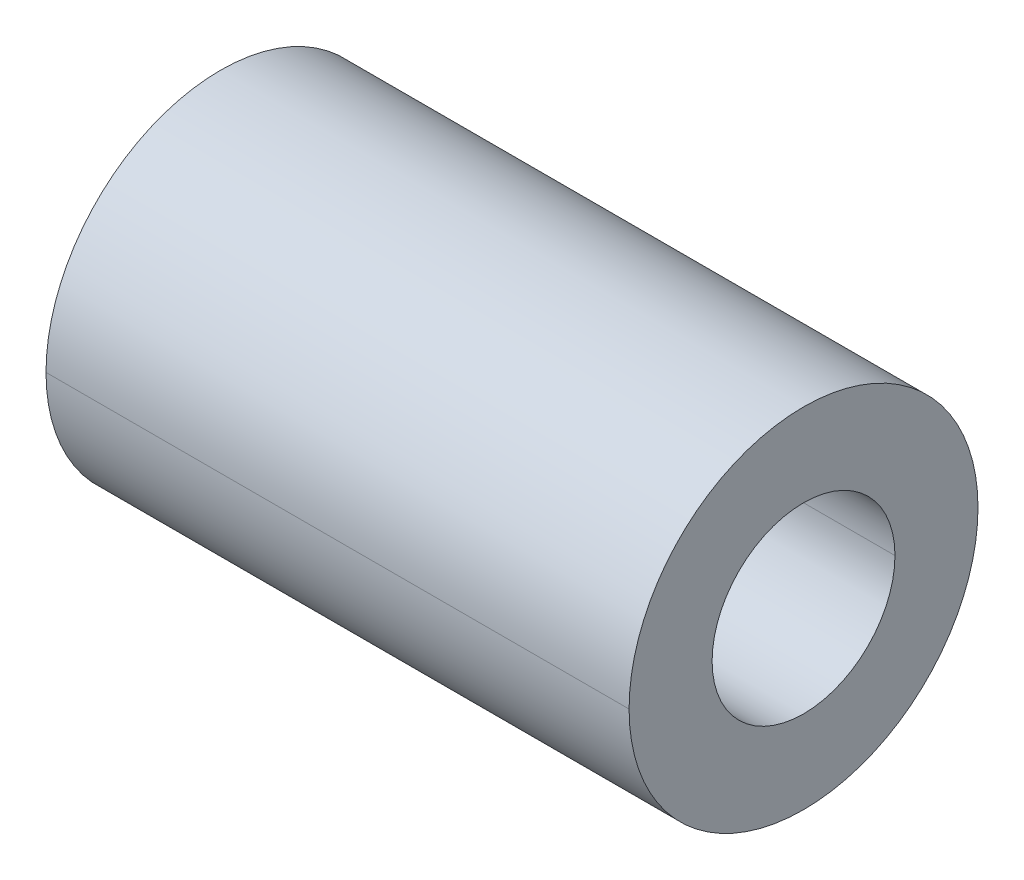
ISO-10303-21;
HEADER;
FILE_DESCRIPTION(('STEP AP214'),'2;1');
FILE_NAME('part.step','',(''),(''),'','','');
FILE_SCHEMA(('AUTOMOTIVE_DESIGN { 1 0 10303 214 1 1 1 1 }'));
ENDSEC;
DATA;
#1=APPLICATION_CONTEXT('core data for automotive mechanical design processes');
#2=APPLICATION_PROTOCOL_DEFINITION('international standard','automotive_design',2000,#1);
#3=PRODUCT_CONTEXT('',#1,'mechanical');
#4=PRODUCT('Part','Part','',(#3));
#5=PRODUCT_RELATED_PRODUCT_CATEGORY('part','',(#4));
#6=PRODUCT_DEFINITION_FORMATION('','',#4);
#7=PRODUCT_DEFINITION_CONTEXT('part definition',#1,'design');
#8=PRODUCT_DEFINITION('design','',#6,#7);
#9=PRODUCT_DEFINITION_SHAPE('','',#8);
#10=(LENGTH_UNIT() NAMED_UNIT(*) SI_UNIT(.MILLI.,.METRE.));
#11=(NAMED_UNIT(*) PLANE_ANGLE_UNIT() SI_UNIT($,.RADIAN.));
#12=(NAMED_UNIT(*) SI_UNIT($,.STERADIAN.) SOLID_ANGLE_UNIT());
#13=UNCERTAINTY_MEASURE_WITH_UNIT(LENGTH_MEASURE(1.E-05),#10,'distance_accuracy_value','');
#14=(GEOMETRIC_REPRESENTATION_CONTEXT(3) GLOBAL_UNCERTAINTY_ASSIGNED_CONTEXT((#13)) GLOBAL_UNIT_ASSIGNED_CONTEXT((#10,
#11,#12)) REPRESENTATION_CONTEXT('',''));
#15=CARTESIAN_POINT('',(0.,0.,0.));
#16=DIRECTION('',(0.,0.,1.));
#17=DIRECTION('',(1.,0.,0.));
#18=AXIS2_PLACEMENT_3D('',#15,#16,#17);
#19=CARTESIAN_POINT('',(7.9375,0.,0.));
#20=DIRECTION('',(-1.,0.,0.));
#21=DIRECTION('',(0.,0.,1.));
#22=AXIS2_PLACEMENT_3D('',#19,#20,#21);
#23=CYLINDRICAL_SURFACE('',#22,2.4892);
#24=DIRECTION('',(-1.,0.,0.));
#25=VECTOR('',#24,1.);
#26=CARTESIAN_POINT('',(7.9375,0.,-2.4892));
#27=LINE('',#26,#25);
#28=CARTESIAN_POINT('',(7.9375,0.,-2.4892));
#29=VERTEX_POINT('',#28);
#30=CARTESIAN_POINT('',(-7.9375,0.,-2.4892));
#31=VERTEX_POINT('',#30);
#32=EDGE_CURVE('E74',#29,#31,#27,.T.);
#33=ORIENTED_EDGE('',*,*,#32,.F.);
#34=CARTESIAN_POINT('',(7.9375,0.,0.));
#35=DIRECTION('',(1.,0.,0.));
#36=DIRECTION('',(0.,0.,-1.));
#37=AXIS2_PLACEMENT_3D('',#34,#35,#36);
#38=CIRCLE('',#37,2.4892);
#39=CARTESIAN_POINT('',(7.9375,0.,2.4892));
#40=VERTEX_POINT('',#39);
#41=EDGE_CURVE('E61',#29,#40,#38,.T.);
#42=ORIENTED_EDGE('',*,*,#41,.T.);
#43=DIRECTION('',(-1.,0.,0.));
#44=VECTOR('',#43,1.);
#45=CARTESIAN_POINT('',(7.9375,0.,2.4892));
#46=LINE('',#45,#44);
#47=CARTESIAN_POINT('',(-7.9375,0.,2.4892));
#48=VERTEX_POINT('',#47);
#49=EDGE_CURVE('E19',#40,#48,#46,.T.);
#50=ORIENTED_EDGE('',*,*,#49,.T.);
#51=CARTESIAN_POINT('',(-7.9375,0.,0.));
#52=DIRECTION('',(1.,0.,0.));
#53=DIRECTION('',(0.,0.,-1.));
#54=AXIS2_PLACEMENT_3D('',#51,#52,#53);
#55=CIRCLE('',#54,2.4892);
#56=EDGE_CURVE('E10',#31,#48,#55,.T.);
#57=ORIENTED_EDGE('',*,*,#56,.F.);
#58=EDGE_LOOP('',(#33,#42,#50,#57));
#59=FACE_BOUND('',#58,.T.);
#60=ADVANCED_FACE('F15',(#59),#23,.F.);
#61=CARTESIAN_POINT('',(7.9375,0.,0.));
#62=DIRECTION('',(-1.,0.,0.));
#63=DIRECTION('',(0.,0.,1.));
#64=AXIS2_PLACEMENT_3D('',#61,#62,#63);
#65=CYLINDRICAL_SURFACE('',#64,4.7498);
#66=DIRECTION('',(-1.,0.,0.));
#67=VECTOR('',#66,1.);
#68=CARTESIAN_POINT('',(7.9375,0.,-4.7498));
#69=LINE('',#68,#67);
#70=CARTESIAN_POINT('',(7.9375,0.,-4.7498));
#71=VERTEX_POINT('',#70);
#72=CARTESIAN_POINT('',(-7.9375,0.,-4.7498));
#73=VERTEX_POINT('',#72);
#74=EDGE_CURVE('E131',#71,#73,#69,.T.);
#75=ORIENTED_EDGE('',*,*,#74,.F.);
#76=CARTESIAN_POINT('',(7.9375,0.,0.));
#77=DIRECTION('',(1.,0.,0.));
#78=DIRECTION('',(0.,0.,-1.));
#79=AXIS2_PLACEMENT_3D('',#76,#77,#78);
#80=CIRCLE('',#79,4.7498);
#81=CARTESIAN_POINT('',(7.9375,0.,4.7498));
#82=VERTEX_POINT('',#81);
#83=EDGE_CURVE('E77',#82,#71,#80,.T.);
#84=ORIENTED_EDGE('',*,*,#83,.F.);
#85=DIRECTION('',(-1.,0.,0.));
#86=VECTOR('',#85,1.);
#87=CARTESIAN_POINT('',(7.9375,0.,4.7498));
#88=LINE('',#87,#86);
#89=CARTESIAN_POINT('',(-7.9375,0.,4.7498));
#90=VERTEX_POINT('',#89);
#91=EDGE_CURVE('E99',#82,#90,#88,.T.);
#92=ORIENTED_EDGE('',*,*,#91,.T.);
#93=CARTESIAN_POINT('',(-7.9375,0.,0.));
#94=DIRECTION('',(1.,0.,0.));
#95=DIRECTION('',(0.,0.,-1.));
#96=AXIS2_PLACEMENT_3D('',#93,#94,#95);
#97=CIRCLE('',#96,4.7498);
#98=EDGE_CURVE('E25',#90,#73,#97,.T.);
#99=ORIENTED_EDGE('',*,*,#98,.T.);
#100=EDGE_LOOP('',(#75,#84,#92,#99));
#101=FACE_BOUND('',#100,.T.);
#102=ADVANCED_FACE('F186',(#101),#65,.T.);
#103=CARTESIAN_POINT('',(-7.9375,0.,0.));
#104=DIRECTION('',(1.,0.,0.));
#105=DIRECTION('',(0.,1.,0.));
#106=AXIS2_PLACEMENT_3D('',#103,#104,#105);
#107=PLANE('',#106);
#108=CARTESIAN_POINT('',(-7.9375,0.,0.));
#109=DIRECTION('',(1.,0.,0.));
#110=DIRECTION('',(0.,0.,-1.));
#111=AXIS2_PLACEMENT_3D('',#108,#109,#110);
#112=CIRCLE('',#111,2.4892);
#113=EDGE_CURVE('E83',#48,#31,#112,.T.);
#114=ORIENTED_EDGE('',*,*,#113,.T.);
#115=ORIENTED_EDGE('',*,*,#56,.T.);
#116=EDGE_LOOP('',(#114,#115));
#117=FACE_BOUND('',#116,.T.);
#118=ORIENTED_EDGE('',*,*,#98,.F.);
#119=CARTESIAN_POINT('',(-7.9375,0.,0.));
#120=DIRECTION('',(1.,0.,0.));
#121=DIRECTION('',(0.,0.,-1.));
#122=AXIS2_PLACEMENT_3D('',#119,#120,#121);
#123=CIRCLE('',#122,4.7498);
#124=EDGE_CURVE('E124',#73,#90,#123,.T.);
#125=ORIENTED_EDGE('',*,*,#124,.F.);
#126=EDGE_LOOP('',(#118,#125));
#127=FACE_BOUND('',#126,.T.);
#128=ADVANCED_FACE('F17',(#117,#127),#107,.F.);
#129=CARTESIAN_POINT('',(7.9375,0.,0.));
#130=DIRECTION('',(1.,0.,0.));
#131=DIRECTION('',(0.,1.,0.));
#132=AXIS2_PLACEMENT_3D('',#129,#130,#131);
#133=PLANE('',#132);
#134=CARTESIAN_POINT('',(7.9375,0.,0.));
#135=DIRECTION('',(1.,0.,0.));
#136=DIRECTION('',(0.,0.,-1.));
#137=AXIS2_PLACEMENT_3D('',#134,#135,#136);
#138=CIRCLE('',#137,2.4892);
#139=EDGE_CURVE('E81',#40,#29,#138,.T.);
#140=ORIENTED_EDGE('',*,*,#139,.F.);
#141=ORIENTED_EDGE('',*,*,#41,.F.);
#142=EDGE_LOOP('',(#140,#141));
#143=FACE_BOUND('',#142,.T.);
#144=ORIENTED_EDGE('',*,*,#83,.T.);
#145=CARTESIAN_POINT('',(7.9375,0.,0.));
#146=DIRECTION('',(1.,0.,0.));
#147=DIRECTION('',(0.,0.,-1.));
#148=AXIS2_PLACEMENT_3D('',#145,#146,#147);
#149=CIRCLE('',#148,4.7498);
#150=EDGE_CURVE('E85',#71,#82,#149,.T.);
#151=ORIENTED_EDGE('',*,*,#150,.T.);
#152=EDGE_LOOP('',(#144,#151));
#153=FACE_BOUND('',#152,.T.);
#154=ADVANCED_FACE('F86',(#143,#153),#133,.T.);
#155=CARTESIAN_POINT('',(7.9375,0.,0.));
#156=DIRECTION('',(-1.,0.,0.));
#157=DIRECTION('',(0.,0.,1.));
#158=AXIS2_PLACEMENT_3D('',#155,#156,#157);
#159=CYLINDRICAL_SURFACE('',#158,4.7498);
#160=ORIENTED_EDGE('',*,*,#150,.F.);
#161=ORIENTED_EDGE('',*,*,#74,.T.);
#162=ORIENTED_EDGE('',*,*,#124,.T.);
#163=ORIENTED_EDGE('',*,*,#91,.F.);
#164=EDGE_LOOP('',(#160,#161,#162,#163));
#165=FACE_BOUND('',#164,.T.);
#166=ADVANCED_FACE('F196',(#165),#159,.T.);
#167=CARTESIAN_POINT('',(7.9375,0.,0.));
#168=DIRECTION('',(-1.,0.,0.));
#169=DIRECTION('',(0.,0.,1.));
#170=AXIS2_PLACEMENT_3D('',#167,#168,#169);
#171=CYLINDRICAL_SURFACE('',#170,2.4892);
#172=ORIENTED_EDGE('',*,*,#139,.T.);
#173=ORIENTED_EDGE('',*,*,#32,.T.);
#174=ORIENTED_EDGE('',*,*,#113,.F.);
#175=ORIENTED_EDGE('',*,*,#49,.F.);
#176=EDGE_LOOP('',(#172,#173,#174,#175));
#177=FACE_BOUND('',#176,.T.);
#178=ADVANCED_FACE('F80',(#177),#171,.F.);
#179=CLOSED_SHELL('',(#60,#102,#128,#154,#166,#178));
#180=MANIFOLD_SOLID_BREP('B1',#179);
#181=ADVANCED_BREP_SHAPE_REPRESENTATION('',(#18,#180),#14);
#182=SHAPE_DEFINITION_REPRESENTATION(#9,#181);
ENDSEC;
END-ISO-10303-21;
